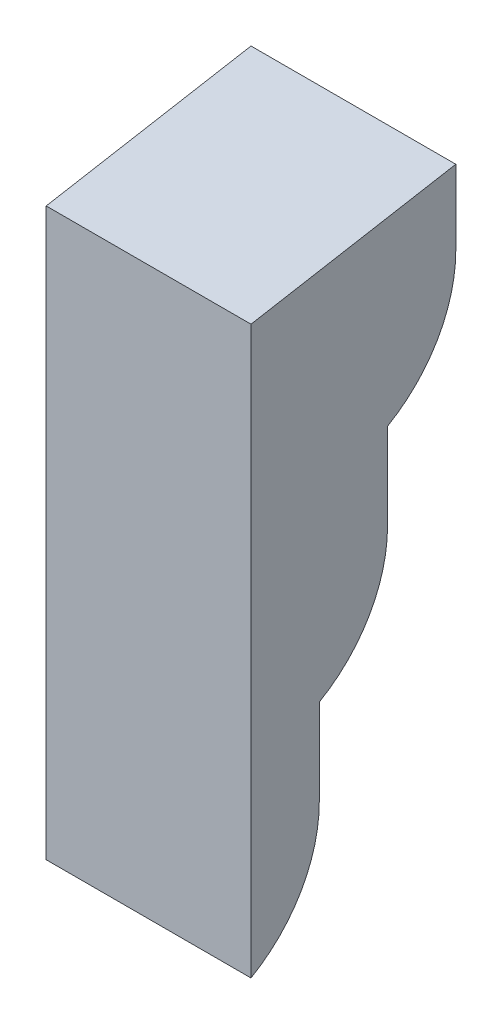
ISO-10303-21;
HEADER;
FILE_DESCRIPTION(('STEP AP214'),'2;1');
FILE_NAME('part.step','',(''),(''),'','','');
FILE_SCHEMA(('AUTOMOTIVE_DESIGN { 1 0 10303 214 1 1 1 1 }'));
ENDSEC;
DATA;
#1=APPLICATION_CONTEXT('core data for automotive mechanical design processes');
#2=APPLICATION_PROTOCOL_DEFINITION('international standard','automotive_design',2000,#1);
#3=PRODUCT_CONTEXT('',#1,'mechanical');
#4=PRODUCT('Part','Part','',(#3));
#5=PRODUCT_RELATED_PRODUCT_CATEGORY('part','',(#4));
#6=PRODUCT_DEFINITION_FORMATION('','',#4);
#7=PRODUCT_DEFINITION_CONTEXT('part definition',#1,'design');
#8=PRODUCT_DEFINITION('design','',#6,#7);
#9=PRODUCT_DEFINITION_SHAPE('','',#8);
#10=(LENGTH_UNIT() NAMED_UNIT(*) SI_UNIT(.MILLI.,.METRE.));
#11=(NAMED_UNIT(*) PLANE_ANGLE_UNIT() SI_UNIT($,.RADIAN.));
#12=(NAMED_UNIT(*) SI_UNIT($,.STERADIAN.) SOLID_ANGLE_UNIT());
#13=UNCERTAINTY_MEASURE_WITH_UNIT(LENGTH_MEASURE(1.E-05),#10,'distance_accuracy_value','');
#14=(GEOMETRIC_REPRESENTATION_CONTEXT(3) GLOBAL_UNCERTAINTY_ASSIGNED_CONTEXT((#13)) GLOBAL_UNIT_ASSIGNED_CONTEXT((#10,
#11,#12)) REPRESENTATION_CONTEXT('',''));
#15=CARTESIAN_POINT('',(0.,0.,0.));
#16=DIRECTION('',(0.,0.,1.));
#17=DIRECTION('',(1.,0.,0.));
#18=AXIS2_PLACEMENT_3D('',#15,#16,#17);
#19=CARTESIAN_POINT('',(-7.5,30.,-15.));
#20=DIRECTION('',(0.,0.,-1.));
#21=DIRECTION('',(-1.,0.,0.));
#22=AXIS2_PLACEMENT_3D('',#19,#20,#21);
#23=PLANE('',#22);
#24=DIRECTION('',(-1.,0.,0.));
#25=VECTOR('',#24,1.);
#26=CARTESIAN_POINT('',(-7.5,44.1165996930438,-15.));
#27=LINE('',#26,#25);
#28=CARTESIAN_POINT('',(7.5,44.1165996930438,-15.));
#29=VERTEX_POINT('',#28);
#30=CARTESIAN_POINT('',(-7.5,44.1165996930438,-15.));
#31=VERTEX_POINT('',#30);
#32=EDGE_CURVE('E101',#29,#31,#27,.T.);
#33=ORIENTED_EDGE('',*,*,#32,.F.);
#34=DIRECTION('',(0.,1.,0.));
#35=VECTOR('',#34,1.);
#36=CARTESIAN_POINT('',(7.5,30.,-15.));
#37=LINE('',#36,#35);
#38=CARTESIAN_POINT('',(7.5,38.6602540378444,-15.));
#39=VERTEX_POINT('',#38);
#40=EDGE_CURVE('E109',#39,#29,#37,.T.);
#41=ORIENTED_EDGE('',*,*,#40,.F.);
#42=DIRECTION('',(-1.,0.,0.));
#43=VECTOR('',#42,1.);
#44=CARTESIAN_POINT('',(-7.5,38.6602540378444,-15.));
#45=LINE('',#44,#43);
#46=CARTESIAN_POINT('',(-7.5,38.6602540378444,-15.));
#47=VERTEX_POINT('',#46);
#48=EDGE_CURVE('E142',#39,#47,#45,.T.);
#49=ORIENTED_EDGE('',*,*,#48,.T.);
#50=DIRECTION('',(0.,1.,0.));
#51=VECTOR('',#50,1.);
#52=CARTESIAN_POINT('',(-7.5,30.,-15.));
#53=LINE('',#52,#51);
#54=EDGE_CURVE('E112',#47,#31,#53,.T.);
#55=ORIENTED_EDGE('',*,*,#54,.T.);
#56=EDGE_LOOP('',(#33,#41,#49,#55));
#57=FACE_BOUND('',#56,.T.);
#58=ADVANCED_FACE('F38',(#57),#23,.T.);
#59=CARTESIAN_POINT('',(-7.5,15.,-10.));
#60=DIRECTION('',(0.,0.,-1.));
#61=DIRECTION('',(-1.,0.,0.));
#62=AXIS2_PLACEMENT_3D('',#59,#60,#61);
#63=PLANE('',#62);
#64=DIRECTION('',(0.,1.,0.));
#65=VECTOR('',#64,1.);
#66=CARTESIAN_POINT('',(7.5,15.,-10.));
#67=LINE('',#66,#65);
#68=CARTESIAN_POINT('',(7.5,23.6602540378444,-10.));
#69=VERTEX_POINT('',#68);
#70=CARTESIAN_POINT('',(7.5,30.,-10.));
#71=VERTEX_POINT('',#70);
#72=EDGE_CURVE('E119',#69,#71,#67,.T.);
#73=ORIENTED_EDGE('',*,*,#72,.F.);
#74=DIRECTION('',(-1.,0.,0.));
#75=VECTOR('',#74,1.);
#76=CARTESIAN_POINT('',(-7.5,23.6602540378444,-10.));
#77=LINE('',#76,#75);
#78=CARTESIAN_POINT('',(-7.5,23.6602540378444,-10.));
#79=VERTEX_POINT('',#78);
#80=EDGE_CURVE('E46',#69,#79,#77,.T.);
#81=ORIENTED_EDGE('',*,*,#80,.T.);
#82=DIRECTION('',(0.,1.,0.));
#83=VECTOR('',#82,1.);
#84=CARTESIAN_POINT('',(-7.5,15.,-10.));
#85=LINE('',#84,#83);
#86=CARTESIAN_POINT('',(-7.5,30.,-10.));
#87=VERTEX_POINT('',#86);
#88=EDGE_CURVE('E129',#79,#87,#85,.T.);
#89=ORIENTED_EDGE('',*,*,#88,.T.);
#90=DIRECTION('',(1.,0.,0.));
#91=VECTOR('',#90,1.);
#92=CARTESIAN_POINT('',(-7.5,30.,-10.));
#93=LINE('',#92,#91);
#94=EDGE_CURVE('E133',#87,#71,#93,.T.);
#95=ORIENTED_EDGE('',*,*,#94,.T.);
#96=EDGE_LOOP('',(#73,#81,#89,#95));
#97=FACE_BOUND('',#96,.T.);
#98=ADVANCED_FACE('F182',(#97),#63,.T.);
#99=CARTESIAN_POINT('',(-7.5,0.,-5.));
#100=DIRECTION('',(0.,0.,-1.));
#101=DIRECTION('',(-1.,0.,0.));
#102=AXIS2_PLACEMENT_3D('',#99,#100,#101);
#103=PLANE('',#102);
#104=DIRECTION('',(0.,1.,0.));
#105=VECTOR('',#104,1.);
#106=CARTESIAN_POINT('',(7.5,0.,-5.));
#107=LINE('',#106,#105);
#108=CARTESIAN_POINT('',(7.5,8.66025403784439,-5.));
#109=VERTEX_POINT('',#108);
#110=CARTESIAN_POINT('',(7.5,15.,-5.));
#111=VERTEX_POINT('',#110);
#112=EDGE_CURVE('E123',#109,#111,#107,.T.);
#113=ORIENTED_EDGE('',*,*,#112,.F.);
#114=DIRECTION('',(1.,0.,0.));
#115=VECTOR('',#114,1.);
#116=CARTESIAN_POINT('',(-7.5,8.66025403784439,-5.));
#117=LINE('',#116,#115);
#118=CARTESIAN_POINT('',(-7.5,8.66025403784439,-5.));
#119=VERTEX_POINT('',#118);
#120=EDGE_CURVE('E151',#109,#119,#117,.F.);
#121=ORIENTED_EDGE('',*,*,#120,.T.);
#122=DIRECTION('',(0.,1.,0.));
#123=VECTOR('',#122,1.);
#124=CARTESIAN_POINT('',(-7.5,0.,-5.));
#125=LINE('',#124,#123);
#126=CARTESIAN_POINT('',(-7.5,15.,-5.));
#127=VERTEX_POINT('',#126);
#128=EDGE_CURVE('E121',#119,#127,#125,.T.);
#129=ORIENTED_EDGE('',*,*,#128,.T.);
#130=DIRECTION('',(1.,0.,0.));
#131=VECTOR('',#130,1.);
#132=CARTESIAN_POINT('',(-7.5,15.,-5.));
#133=LINE('',#132,#131);
#134=EDGE_CURVE('E136',#127,#111,#133,.T.);
#135=ORIENTED_EDGE('',*,*,#134,.T.);
#136=EDGE_LOOP('',(#113,#121,#129,#135));
#137=FACE_BOUND('',#136,.T.);
#138=ADVANCED_FACE('F177',(#137),#103,.T.);
#139=CARTESIAN_POINT('',(-7.5,45.,0.));
#140=DIRECTION('',(0.,0.,1.));
#141=DIRECTION('',(0.,-1.,0.));
#142=AXIS2_PLACEMENT_3D('',#139,#140,#141);
#143=PLANE('',#142);
#144=DIRECTION('',(1.,0.,0.));
#145=VECTOR('',#144,1.);
#146=CARTESIAN_POINT('',(-7.5,41.4716949824169,0.));
#147=LINE('',#146,#145);
#148=CARTESIAN_POINT('',(-7.5,41.4716949824169,0.));
#149=VERTEX_POINT('',#148);
#150=CARTESIAN_POINT('',(7.5,41.4716949824169,0.));
#151=VERTEX_POINT('',#150);
#152=EDGE_CURVE('E52',#149,#151,#147,.T.);
#153=ORIENTED_EDGE('',*,*,#152,.F.);
#154=DIRECTION('',(0.,-1.,0.));
#155=VECTOR('',#154,1.);
#156=CARTESIAN_POINT('',(-7.5,45.,0.));
#157=LINE('',#156,#155);
#158=CARTESIAN_POINT('',(-7.5,0.,0.));
#159=VERTEX_POINT('',#158);
#160=EDGE_CURVE('E118',#149,#159,#157,.T.);
#161=ORIENTED_EDGE('',*,*,#160,.T.);
#162=DIRECTION('',(1.,0.,0.));
#163=VECTOR('',#162,1.);
#164=CARTESIAN_POINT('',(-7.5,0.,0.));
#165=LINE('',#164,#163);
#166=CARTESIAN_POINT('',(7.5,0.,0.));
#167=VERTEX_POINT('',#166);
#168=EDGE_CURVE('E132',#159,#167,#165,.T.);
#169=ORIENTED_EDGE('',*,*,#168,.T.);
#170=DIRECTION('',(0.,-1.,0.));
#171=VECTOR('',#170,1.);
#172=CARTESIAN_POINT('',(7.5,45.,0.));
#173=LINE('',#172,#171);
#174=EDGE_CURVE('E113',#151,#167,#173,.T.);
#175=ORIENTED_EDGE('',*,*,#174,.F.);
#176=EDGE_LOOP('',(#153,#161,#169,#175));
#177=FACE_BOUND('',#176,.T.);
#178=ADVANCED_FACE('F168',(#177),#143,.T.);
#179=CARTESIAN_POINT('',(-7.5,0.,0.));
#180=DIRECTION('',(1.,0.,0.));
#181=DIRECTION('',(0.,0.,-1.));
#182=AXIS2_PLACEMENT_3D('',#179,#180,#181);
#183=PLANE('',#182);
#184=ORIENTED_EDGE('',*,*,#160,.F.);
#185=DIRECTION('',(0.,0.173648177666924,-0.984807753012209));
#186=VECTOR('',#185,1.);
#187=CARTESIAN_POINT('',(-7.5,40.2211703644391,7.09207753092205));
#188=LINE('',#187,#186);
#189=EDGE_CURVE('E169',#149,#31,#188,.T.);
#190=ORIENTED_EDGE('',*,*,#189,.T.);
#191=ORIENTED_EDGE('',*,*,#54,.F.);
#192=CARTESIAN_POINT('',(-7.5,38.6602540378444,-5.));
#193=DIRECTION('',(1.,0.,0.));
#194=DIRECTION('',(0.,0.,-1.));
#195=AXIS2_PLACEMENT_3D('',#192,#193,#194);
#196=CIRCLE('',#195,10.);
#197=EDGE_CURVE('E144',#47,#87,#196,.F.);
#198=ORIENTED_EDGE('',*,*,#197,.T.);
#199=ORIENTED_EDGE('',*,*,#88,.F.);
#200=CARTESIAN_POINT('',(-7.5,23.6602540378444,0.));
#201=DIRECTION('',(1.,0.,0.));
#202=DIRECTION('',(0.,0.,-1.));
#203=AXIS2_PLACEMENT_3D('',#200,#201,#202);
#204=CIRCLE('',#203,10.);
#205=EDGE_CURVE('E153',#79,#127,#204,.F.);
#206=ORIENTED_EDGE('',*,*,#205,.T.);
#207=ORIENTED_EDGE('',*,*,#128,.F.);
#208=CARTESIAN_POINT('',(-7.5,8.66025403784439,5.));
#209=DIRECTION('',(1.,0.,0.));
#210=DIRECTION('',(0.,0.,-1.));
#211=AXIS2_PLACEMENT_3D('',#208,#209,#210);
#212=CIRCLE('',#211,10.);
#213=EDGE_CURVE('E155',#119,#159,#212,.F.);
#214=ORIENTED_EDGE('',*,*,#213,.T.);
#215=EDGE_LOOP('',(#184,#190,#191,#198,#199,#206,#207,#214));
#216=FACE_BOUND('',#215,.T.);
#217=ADVANCED_FACE('F162',(#216),#183,.F.);
#218=CARTESIAN_POINT('',(7.5,0.,0.));
#219=DIRECTION('',(1.,0.,0.));
#220=DIRECTION('',(0.,0.,-1.));
#221=AXIS2_PLACEMENT_3D('',#218,#219,#220);
#222=PLANE('',#221);
#223=DIRECTION('',(0.,0.173648177666924,-0.984807753012209));
#224=VECTOR('',#223,1.);
#225=CARTESIAN_POINT('',(7.5,40.2211703644391,7.09207753092205));
#226=LINE('',#225,#224);
#227=EDGE_CURVE('E11',#151,#29,#226,.T.);
#228=ORIENTED_EDGE('',*,*,#227,.F.);
#229=ORIENTED_EDGE('',*,*,#174,.T.);
#230=CARTESIAN_POINT('',(7.5,8.66025403784439,5.));
#231=DIRECTION('',(1.,0.,0.));
#232=DIRECTION('',(0.,0.,-1.));
#233=AXIS2_PLACEMENT_3D('',#230,#231,#232);
#234=CIRCLE('',#233,10.);
#235=EDGE_CURVE('E149',#167,#109,#234,.T.);
#236=ORIENTED_EDGE('',*,*,#235,.T.);
#237=ORIENTED_EDGE('',*,*,#112,.T.);
#238=CARTESIAN_POINT('',(7.5,23.6602540378444,0.));
#239=DIRECTION('',(1.,0.,0.));
#240=DIRECTION('',(0.,0.,-1.));
#241=AXIS2_PLACEMENT_3D('',#238,#239,#240);
#242=CIRCLE('',#241,10.);
#243=EDGE_CURVE('E147',#111,#69,#242,.T.);
#244=ORIENTED_EDGE('',*,*,#243,.T.);
#245=ORIENTED_EDGE('',*,*,#72,.T.);
#246=CARTESIAN_POINT('',(7.5,38.6602540378444,-5.));
#247=DIRECTION('',(1.,0.,0.));
#248=DIRECTION('',(0.,0.,-1.));
#249=AXIS2_PLACEMENT_3D('',#246,#247,#248);
#250=CIRCLE('',#249,10.);
#251=EDGE_CURVE('E117',#71,#39,#250,.T.);
#252=ORIENTED_EDGE('',*,*,#251,.T.);
#253=ORIENTED_EDGE('',*,*,#40,.T.);
#254=EDGE_LOOP('',(#228,#229,#236,#237,#244,#245,#252,#253));
#255=FACE_BOUND('',#254,.T.);
#256=ADVANCED_FACE('F115',(#255),#222,.T.);
#257=CARTESIAN_POINT('',(-7.5,38.6602540378444,-5.));
#258=DIRECTION('',(1.,0.,0.));
#259=DIRECTION('',(0.,0.,-1.));
#260=AXIS2_PLACEMENT_3D('',#257,#258,#259);
#261=CYLINDRICAL_SURFACE('',#260,10.);
#262=ORIENTED_EDGE('',*,*,#197,.F.);
#263=ORIENTED_EDGE('',*,*,#48,.F.);
#264=ORIENTED_EDGE('',*,*,#251,.F.);
#265=ORIENTED_EDGE('',*,*,#94,.F.);
#266=EDGE_LOOP('',(#262,#263,#264,#265));
#267=FACE_BOUND('',#266,.T.);
#268=ADVANCED_FACE('F184',(#267),#261,.T.);
#269=CARTESIAN_POINT('',(-7.5,8.66025403784439,5.));
#270=DIRECTION('',(-1.,0.,0.));
#271=DIRECTION('',(0.,0.,1.));
#272=AXIS2_PLACEMENT_3D('',#269,#270,#271);
#273=CYLINDRICAL_SURFACE('',#272,10.);
#274=ORIENTED_EDGE('',*,*,#213,.F.);
#275=ORIENTED_EDGE('',*,*,#120,.F.);
#276=ORIENTED_EDGE('',*,*,#235,.F.);
#277=ORIENTED_EDGE('',*,*,#168,.F.);
#278=EDGE_LOOP('',(#274,#275,#276,#277));
#279=FACE_BOUND('',#278,.T.);
#280=ADVANCED_FACE('F166',(#279),#273,.T.);
#281=CARTESIAN_POINT('',(-7.5,23.6602540378444,0.));
#282=DIRECTION('',(1.,0.,0.));
#283=DIRECTION('',(0.,0.,-1.));
#284=AXIS2_PLACEMENT_3D('',#281,#282,#283);
#285=CYLINDRICAL_SURFACE('',#284,10.);
#286=ORIENTED_EDGE('',*,*,#205,.F.);
#287=ORIENTED_EDGE('',*,*,#80,.F.);
#288=ORIENTED_EDGE('',*,*,#243,.F.);
#289=ORIENTED_EDGE('',*,*,#134,.F.);
#290=EDGE_LOOP('',(#286,#287,#288,#289));
#291=FACE_BOUND('',#290,.T.);
#292=ADVANCED_FACE('F40',(#291),#285,.T.);
#293=CARTESIAN_POINT('',(-17.,45.,-20.0100121002858));
#294=DIRECTION('',(0.,-0.984807753012209,-0.173648177666924));
#295=DIRECTION('',(0.,0.173648177666924,-0.984807753012209));
#296=AXIS2_PLACEMENT_3D('',#293,#294,#295);
#297=PLANE('',#296);
#298=ORIENTED_EDGE('',*,*,#32,.T.);
#299=ORIENTED_EDGE('',*,*,#189,.F.);
#300=ORIENTED_EDGE('',*,*,#152,.T.);
#301=ORIENTED_EDGE('',*,*,#227,.T.);
#302=EDGE_LOOP('',(#298,#299,#300,#301));
#303=FACE_BOUND('',#302,.T.);
#304=ADVANCED_FACE('F100',(#303),#297,.F.);
#305=CLOSED_SHELL('',(#58,#98,#138,#178,#217,#256,#268,#280,#292,#304));
#306=MANIFOLD_SOLID_BREP('B2',#305);
#307=ADVANCED_BREP_SHAPE_REPRESENTATION('',(#18,#306),#14);
#308=SHAPE_DEFINITION_REPRESENTATION(#9,#307);
ENDSEC;
END-ISO-10303-21;
